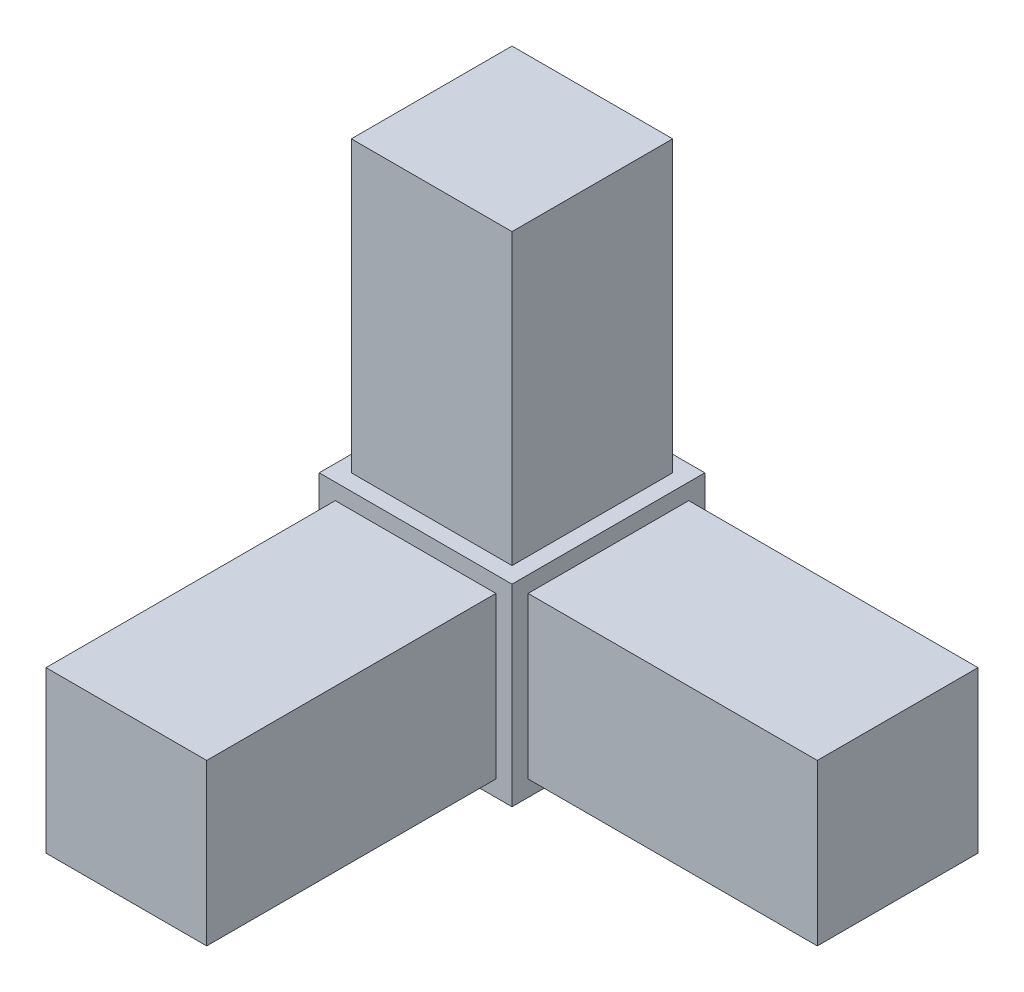
ISO-10303-21;
HEADER;
FILE_DESCRIPTION(('STEP AP214'),'2;1');
FILE_NAME('part.step','',(''),(''),'','','');
FILE_SCHEMA(('AUTOMOTIVE_DESIGN { 1 0 10303 214 1 1 1 1 }'));
ENDSEC;
DATA;
#1=APPLICATION_CONTEXT('core data for automotive mechanical design processes');
#2=APPLICATION_PROTOCOL_DEFINITION('international standard','automotive_design',2000,#1);
#3=PRODUCT_CONTEXT('',#1,'mechanical');
#4=PRODUCT('Part','Part','',(#3));
#5=PRODUCT_RELATED_PRODUCT_CATEGORY('part','',(#4));
#6=PRODUCT_DEFINITION_FORMATION('','',#4);
#7=PRODUCT_DEFINITION_CONTEXT('part definition',#1,'design');
#8=PRODUCT_DEFINITION('design','',#6,#7);
#9=PRODUCT_DEFINITION_SHAPE('','',#8);
#10=(LENGTH_UNIT() NAMED_UNIT(*) SI_UNIT(.MILLI.,.METRE.));
#11=(NAMED_UNIT(*) PLANE_ANGLE_UNIT() SI_UNIT($,.RADIAN.));
#12=(NAMED_UNIT(*) SI_UNIT($,.STERADIAN.) SOLID_ANGLE_UNIT());
#13=UNCERTAINTY_MEASURE_WITH_UNIT(LENGTH_MEASURE(1.E-05),#10,'distance_accuracy_value','');
#14=(GEOMETRIC_REPRESENTATION_CONTEXT(3) GLOBAL_UNCERTAINTY_ASSIGNED_CONTEXT((#13)) GLOBAL_UNIT_ASSIGNED_CONTEXT((#10,
#11,#12)) REPRESENTATION_CONTEXT('',''));
#15=CARTESIAN_POINT('',(0.,0.,0.));
#16=DIRECTION('',(0.,0.,1.));
#17=DIRECTION('',(1.,0.,0.));
#18=AXIS2_PLACEMENT_3D('',#15,#16,#17);
#19=CARTESIAN_POINT('',(0.,0.,19.05));
#20=DIRECTION('',(0.,0.,1.));
#21=DIRECTION('',(1.,0.,0.));
#22=AXIS2_PLACEMENT_3D('',#19,#20,#21);
#23=PLANE('',#22);
#24=DIRECTION('',(0.,-1.,0.));
#25=VECTOR('',#24,1.);
#26=CARTESIAN_POINT('',(-9.525,-9.525,19.05));
#27=LINE('',#26,#25);
#28=CARTESIAN_POINT('',(-9.525,9.525,19.05));
#29=VERTEX_POINT('',#28);
#30=CARTESIAN_POINT('',(-9.525,-9.525,19.05));
#31=VERTEX_POINT('',#30);
#32=EDGE_CURVE('E239',#29,#31,#27,.T.);
#33=ORIENTED_EDGE('',*,*,#32,.T.);
#34=DIRECTION('',(1.,0.,0.));
#35=VECTOR('',#34,1.);
#36=CARTESIAN_POINT('',(9.525,-9.525,19.05));
#37=LINE('',#36,#35);
#38=CARTESIAN_POINT('',(9.525,-9.525,19.05));
#39=VERTEX_POINT('',#38);
#40=EDGE_CURVE('E242',#31,#39,#37,.T.);
#41=ORIENTED_EDGE('',*,*,#40,.T.);
#42=DIRECTION('',(0.,1.,0.));
#43=VECTOR('',#42,1.);
#44=CARTESIAN_POINT('',(9.525,-9.525,19.05));
#45=LINE('',#44,#43);
#46=CARTESIAN_POINT('',(9.525,9.525,19.05));
#47=VERTEX_POINT('',#46);
#48=EDGE_CURVE('E245',#39,#47,#45,.T.);
#49=ORIENTED_EDGE('',*,*,#48,.T.);
#50=DIRECTION('',(-1.,0.,0.));
#51=VECTOR('',#50,1.);
#52=CARTESIAN_POINT('',(9.525,9.525,19.05));
#53=LINE('',#52,#51);
#54=EDGE_CURVE('E247',#47,#29,#53,.T.);
#55=ORIENTED_EDGE('',*,*,#54,.T.);
#56=EDGE_LOOP('',(#33,#41,#49,#55));
#57=FACE_BOUND('',#56,.T.);
#58=DIRECTION('',(1.,0.,0.));
#59=VECTOR('',#58,1.);
#60=CARTESIAN_POINT('',(7.9375,-7.9375,19.05));
#61=LINE('',#60,#59);
#62=CARTESIAN_POINT('',(-7.9375,-7.9375,19.05));
#63=VERTEX_POINT('',#62);
#64=CARTESIAN_POINT('',(7.9375,-7.9375,19.05));
#65=VERTEX_POINT('',#64);
#66=EDGE_CURVE('E479',#63,#65,#61,.T.);
#67=ORIENTED_EDGE('',*,*,#66,.F.);
#68=DIRECTION('',(0.,-1.,0.));
#69=VECTOR('',#68,1.);
#70=CARTESIAN_POINT('',(-7.9375,-7.9375,19.05));
#71=LINE('',#70,#69);
#72=CARTESIAN_POINT('',(-7.9375,7.9375,19.05));
#73=VERTEX_POINT('',#72);
#74=EDGE_CURVE('E169',#73,#63,#71,.T.);
#75=ORIENTED_EDGE('',*,*,#74,.F.);
#76=DIRECTION('',(-1.,0.,0.));
#77=VECTOR('',#76,1.);
#78=CARTESIAN_POINT('',(7.9375,7.9375,19.05));
#79=LINE('',#78,#77);
#80=CARTESIAN_POINT('',(7.9375,7.9375,19.05));
#81=VERTEX_POINT('',#80);
#82=EDGE_CURVE('E165',#81,#73,#79,.T.);
#83=ORIENTED_EDGE('',*,*,#82,.F.);
#84=DIRECTION('',(0.,1.,0.));
#85=VECTOR('',#84,1.);
#86=CARTESIAN_POINT('',(7.9375,-7.9375,19.05));
#87=LINE('',#86,#85);
#88=EDGE_CURVE('E476',#65,#81,#87,.T.);
#89=ORIENTED_EDGE('',*,*,#88,.F.);
#90=EDGE_LOOP('',(#67,#75,#83,#89));
#91=FACE_BOUND('',#90,.T.);
#92=ADVANCED_FACE('F33',(#57,#91),#23,.T.);
#93=CARTESIAN_POINT('',(9.525,-9.525,19.05));
#94=DIRECTION('',(-1.,0.,0.));
#95=DIRECTION('',(0.,0.,1.));
#96=AXIS2_PLACEMENT_3D('',#93,#94,#95);
#97=PLANE('',#96);
#98=DIRECTION('',(0.,1.,0.));
#99=VECTOR('',#98,1.);
#100=CARTESIAN_POINT('',(9.525,-9.525,0.));
#101=LINE('',#100,#99);
#102=CARTESIAN_POINT('',(9.525,-9.525,0.));
#103=VERTEX_POINT('',#102);
#104=CARTESIAN_POINT('',(9.525,9.525,0.));
#105=VERTEX_POINT('',#104);
#106=EDGE_CURVE('E254',#103,#105,#101,.T.);
#107=ORIENTED_EDGE('',*,*,#106,.T.);
#108=DIRECTION('',(0.,0.,-1.));
#109=VECTOR('',#108,1.);
#110=CARTESIAN_POINT('',(9.525,9.525,19.05));
#111=LINE('',#110,#109);
#112=EDGE_CURVE('E259',#47,#105,#111,.T.);
#113=ORIENTED_EDGE('',*,*,#112,.F.);
#114=ORIENTED_EDGE('',*,*,#48,.F.);
#115=DIRECTION('',(0.,0.,-1.));
#116=VECTOR('',#115,1.);
#117=CARTESIAN_POINT('',(9.525,-9.525,19.05));
#118=LINE('',#117,#116);
#119=EDGE_CURVE('E41',#39,#103,#118,.T.);
#120=ORIENTED_EDGE('',*,*,#119,.T.);
#121=EDGE_LOOP('',(#107,#113,#114,#120));
#122=FACE_BOUND('',#121,.T.);
#123=DIRECTION('',(0.,1.,0.));
#124=VECTOR('',#123,1.);
#125=CARTESIAN_POINT('',(9.525,-7.93749999999999,1.5875));
#126=LINE('',#125,#124);
#127=CARTESIAN_POINT('',(9.525,-7.93749999999999,1.5875));
#128=VERTEX_POINT('',#127);
#129=CARTESIAN_POINT('',(9.525,7.93750000000001,1.58750000000001));
#130=VERTEX_POINT('',#129);
#131=EDGE_CURVE('E171',#128,#130,#126,.T.);
#132=ORIENTED_EDGE('',*,*,#131,.F.);
#133=DIRECTION('',(0.,0.,-1.));
#134=VECTOR('',#133,1.);
#135=CARTESIAN_POINT('',(9.525,-7.93749999999999,17.4625));
#136=LINE('',#135,#134);
#137=CARTESIAN_POINT('',(9.525,-7.93749999999999,17.4625));
#138=VERTEX_POINT('',#137);
#139=EDGE_CURVE('E182',#138,#128,#136,.T.);
#140=ORIENTED_EDGE('',*,*,#139,.F.);
#141=DIRECTION('',(0.,-1.,0.));
#142=VECTOR('',#141,1.);
#143=CARTESIAN_POINT('',(9.525,-7.93749999999999,17.4625));
#144=LINE('',#143,#142);
#145=CARTESIAN_POINT('',(9.525,7.9375,17.4625));
#146=VERTEX_POINT('',#145);
#147=EDGE_CURVE('E190',#146,#138,#144,.T.);
#148=ORIENTED_EDGE('',*,*,#147,.F.);
#149=DIRECTION('',(0.,0.,1.));
#150=VECTOR('',#149,1.);
#151=CARTESIAN_POINT('',(9.525,7.93750000000001,17.4625));
#152=LINE('',#151,#150);
#153=EDGE_CURVE('E56',#130,#146,#152,.T.);
#154=ORIENTED_EDGE('',*,*,#153,.F.);
#155=EDGE_LOOP('',(#132,#140,#148,#154));
#156=FACE_BOUND('',#155,.T.);
#157=ADVANCED_FACE('F266',(#122,#156),#97,.F.);
#158=CARTESIAN_POINT('',(9.525,9.525,19.05));
#159=DIRECTION('',(0.,-1.,0.));
#160=DIRECTION('',(1.,0.,0.));
#161=AXIS2_PLACEMENT_3D('',#158,#159,#160);
#162=PLANE('',#161);
#163=DIRECTION('',(-1.,0.,0.));
#164=VECTOR('',#163,1.);
#165=CARTESIAN_POINT('',(9.525,9.525,0.));
#166=LINE('',#165,#164);
#167=CARTESIAN_POINT('',(-9.525,9.525,0.));
#168=VERTEX_POINT('',#167);
#169=EDGE_CURVE('E243',#105,#168,#166,.T.);
#170=ORIENTED_EDGE('',*,*,#169,.T.);
#171=DIRECTION('',(0.,0.,-1.));
#172=VECTOR('',#171,1.);
#173=CARTESIAN_POINT('',(-9.525,9.525,19.05));
#174=LINE('',#173,#172);
#175=EDGE_CURVE('E249',#29,#168,#174,.T.);
#176=ORIENTED_EDGE('',*,*,#175,.F.);
#177=ORIENTED_EDGE('',*,*,#54,.F.);
#178=ORIENTED_EDGE('',*,*,#112,.T.);
#179=EDGE_LOOP('',(#170,#176,#177,#178));
#180=FACE_BOUND('',#179,.T.);
#181=DIRECTION('',(0.,0.,-1.));
#182=VECTOR('',#181,1.);
#183=CARTESIAN_POINT('',(7.9375,9.525,1.58750000000001));
#184=LINE('',#183,#182);
#185=CARTESIAN_POINT('',(7.9375,9.525,17.4625));
#186=VERTEX_POINT('',#185);
#187=CARTESIAN_POINT('',(7.9375,9.525,1.58750000000001));
#188=VERTEX_POINT('',#187);
#189=EDGE_CURVE('E205',#186,#188,#184,.T.);
#190=ORIENTED_EDGE('',*,*,#189,.F.);
#191=DIRECTION('',(1.,0.,0.));
#192=VECTOR('',#191,1.);
#193=CARTESIAN_POINT('',(-7.9375,9.525,17.4625));
#194=LINE('',#193,#192);
#195=CARTESIAN_POINT('',(-7.9375,9.525,17.4625));
#196=VERTEX_POINT('',#195);
#197=EDGE_CURVE('E210',#196,#186,#194,.T.);
#198=ORIENTED_EDGE('',*,*,#197,.F.);
#199=DIRECTION('',(0.,0.,1.));
#200=VECTOR('',#199,1.);
#201=CARTESIAN_POINT('',(-7.9375,9.525,1.58750000000001));
#202=LINE('',#201,#200);
#203=CARTESIAN_POINT('',(-7.9375,9.525,1.58750000000001));
#204=VERTEX_POINT('',#203);
#205=EDGE_CURVE('E222',#204,#196,#202,.T.);
#206=ORIENTED_EDGE('',*,*,#205,.F.);
#207=DIRECTION('',(-1.,0.,0.));
#208=VECTOR('',#207,1.);
#209=CARTESIAN_POINT('',(-7.9375,9.525,1.58750000000001));
#210=LINE('',#209,#208);
#211=EDGE_CURVE('E219',#188,#204,#210,.T.);
#212=ORIENTED_EDGE('',*,*,#211,.F.);
#213=EDGE_LOOP('',(#190,#198,#206,#212));
#214=FACE_BOUND('',#213,.T.);
#215=ADVANCED_FACE('F275',(#180,#214),#162,.F.);
#216=CARTESIAN_POINT('',(-9.525,-9.525,19.05));
#217=DIRECTION('',(1.,0.,0.));
#218=DIRECTION('',(0.,0.,-1.));
#219=AXIS2_PLACEMENT_3D('',#216,#217,#218);
#220=PLANE('',#219);
#221=DIRECTION('',(0.,-1.,0.));
#222=VECTOR('',#221,1.);
#223=CARTESIAN_POINT('',(-9.525,-9.525,0.));
#224=LINE('',#223,#222);
#225=CARTESIAN_POINT('',(-9.525,-9.525,0.));
#226=VERTEX_POINT('',#225);
#227=EDGE_CURVE('E238',#168,#226,#224,.T.);
#228=ORIENTED_EDGE('',*,*,#227,.T.);
#229=DIRECTION('',(0.,0.,-1.));
#230=VECTOR('',#229,1.);
#231=CARTESIAN_POINT('',(-9.525,-9.525,19.05));
#232=LINE('',#231,#230);
#233=EDGE_CURVE('E11',#31,#226,#232,.T.);
#234=ORIENTED_EDGE('',*,*,#233,.F.);
#235=ORIENTED_EDGE('',*,*,#32,.F.);
#236=ORIENTED_EDGE('',*,*,#175,.T.);
#237=EDGE_LOOP('',(#228,#234,#235,#236));
#238=FACE_BOUND('',#237,.T.);
#239=ADVANCED_FACE('F35',(#238),#220,.F.);
#240=CARTESIAN_POINT('',(9.525,-9.525,19.05));
#241=DIRECTION('',(0.,1.,0.));
#242=DIRECTION('',(-1.,0.,0.));
#243=AXIS2_PLACEMENT_3D('',#240,#241,#242);
#244=PLANE('',#243);
#245=DIRECTION('',(1.,0.,0.));
#246=VECTOR('',#245,1.);
#247=CARTESIAN_POINT('',(9.525,-9.525,0.));
#248=LINE('',#247,#246);
#249=EDGE_CURVE('E252',#226,#103,#248,.T.);
#250=ORIENTED_EDGE('',*,*,#249,.T.);
#251=ORIENTED_EDGE('',*,*,#119,.F.);
#252=ORIENTED_EDGE('',*,*,#40,.F.);
#253=ORIENTED_EDGE('',*,*,#233,.T.);
#254=EDGE_LOOP('',(#250,#251,#252,#253));
#255=FACE_BOUND('',#254,.T.);
#256=ADVANCED_FACE('F283',(#255),#244,.F.);
#257=CARTESIAN_POINT('',(0.,0.,0.));
#258=DIRECTION('',(0.,0.,1.));
#259=DIRECTION('',(1.,0.,0.));
#260=AXIS2_PLACEMENT_3D('',#257,#258,#259);
#261=PLANE('',#260);
#262=ORIENTED_EDGE('',*,*,#227,.F.);
#263=ORIENTED_EDGE('',*,*,#169,.F.);
#264=ORIENTED_EDGE('',*,*,#106,.F.);
#265=ORIENTED_EDGE('',*,*,#249,.F.);
#266=EDGE_LOOP('',(#262,#263,#264,#265));
#267=FACE_BOUND('',#266,.T.);
#268=ADVANCED_FACE('F272',(#267),#261,.F.);
#269=CARTESIAN_POINT('',(7.9375,38.1,1.58750000000001));
#270=DIRECTION('',(-1.,0.,0.));
#271=DIRECTION('',(0.,0.,1.));
#272=AXIS2_PLACEMENT_3D('',#269,#270,#271);
#273=PLANE('',#272);
#274=ORIENTED_EDGE('',*,*,#189,.T.);
#275=DIRECTION('',(0.,-1.,0.));
#276=VECTOR('',#275,1.);
#277=CARTESIAN_POINT('',(7.9375,38.1,1.58750000000001));
#278=LINE('',#277,#276);
#279=CARTESIAN_POINT('',(7.9375,38.1,1.58750000000001));
#280=VERTEX_POINT('',#279);
#281=EDGE_CURVE('E235',#280,#188,#278,.T.);
#282=ORIENTED_EDGE('',*,*,#281,.F.);
#283=DIRECTION('',(0.,0.,-1.));
#284=VECTOR('',#283,1.);
#285=CARTESIAN_POINT('',(7.9375,38.1,1.58750000000001));
#286=LINE('',#285,#284);
#287=CARTESIAN_POINT('',(7.9375,38.1,17.4625));
#288=VERTEX_POINT('',#287);
#289=EDGE_CURVE('E206',#288,#280,#286,.T.);
#290=ORIENTED_EDGE('',*,*,#289,.F.);
#291=DIRECTION('',(0.,-1.,0.));
#292=VECTOR('',#291,1.);
#293=CARTESIAN_POINT('',(7.9375,38.1,17.4625));
#294=LINE('',#293,#292);
#295=EDGE_CURVE('E216',#288,#186,#294,.T.);
#296=ORIENTED_EDGE('',*,*,#295,.T.);
#297=EDGE_LOOP('',(#274,#282,#290,#296));
#298=FACE_BOUND('',#297,.T.);
#299=ADVANCED_FACE('F289',(#298),#273,.F.);
#300=CARTESIAN_POINT('',(-7.9375,38.1,1.58750000000001));
#301=DIRECTION('',(0.,0.,1.));
#302=DIRECTION('',(1.,0.,0.));
#303=AXIS2_PLACEMENT_3D('',#300,#301,#302);
#304=PLANE('',#303);
#305=ORIENTED_EDGE('',*,*,#211,.T.);
#306=DIRECTION('',(0.,-1.,0.));
#307=VECTOR('',#306,1.);
#308=CARTESIAN_POINT('',(-7.9375,38.1,1.58750000000001));
#309=LINE('',#308,#307);
#310=CARTESIAN_POINT('',(-7.9375,38.1,1.58750000000001));
#311=VERTEX_POINT('',#310);
#312=EDGE_CURVE('E232',#311,#204,#309,.T.);
#313=ORIENTED_EDGE('',*,*,#312,.F.);
#314=DIRECTION('',(-1.,0.,0.));
#315=VECTOR('',#314,1.);
#316=CARTESIAN_POINT('',(-7.9375,38.1,1.58750000000001));
#317=LINE('',#316,#315);
#318=EDGE_CURVE('E209',#280,#311,#317,.T.);
#319=ORIENTED_EDGE('',*,*,#318,.F.);
#320=ORIENTED_EDGE('',*,*,#281,.T.);
#321=EDGE_LOOP('',(#305,#313,#319,#320));
#322=FACE_BOUND('',#321,.T.);
#323=ADVANCED_FACE('F327',(#322),#304,.F.);
#324=CARTESIAN_POINT('',(-7.9375,38.1,1.58750000000001));
#325=DIRECTION('',(1.,0.,0.));
#326=DIRECTION('',(0.,0.,-1.));
#327=AXIS2_PLACEMENT_3D('',#324,#325,#326);
#328=PLANE('',#327);
#329=ORIENTED_EDGE('',*,*,#205,.T.);
#330=DIRECTION('',(0.,-1.,0.));
#331=VECTOR('',#330,1.);
#332=CARTESIAN_POINT('',(-7.9375,38.1,17.4625));
#333=LINE('',#332,#331);
#334=CARTESIAN_POINT('',(-7.9375,38.1,17.4625));
#335=VERTEX_POINT('',#334);
#336=EDGE_CURVE('E229',#335,#196,#333,.T.);
#337=ORIENTED_EDGE('',*,*,#336,.F.);
#338=DIRECTION('',(0.,0.,1.));
#339=VECTOR('',#338,1.);
#340=CARTESIAN_POINT('',(-7.9375,38.1,1.58750000000001));
#341=LINE('',#340,#339);
#342=EDGE_CURVE('E212',#311,#335,#341,.T.);
#343=ORIENTED_EDGE('',*,*,#342,.F.);
#344=ORIENTED_EDGE('',*,*,#312,.T.);
#345=EDGE_LOOP('',(#329,#337,#343,#344));
#346=FACE_BOUND('',#345,.T.);
#347=ADVANCED_FACE('F334',(#346),#328,.F.);
#348=CARTESIAN_POINT('',(-7.9375,38.1,17.4625));
#349=DIRECTION('',(0.,0.,-1.));
#350=DIRECTION('',(-1.,0.,0.));
#351=AXIS2_PLACEMENT_3D('',#348,#349,#350);
#352=PLANE('',#351);
#353=ORIENTED_EDGE('',*,*,#197,.T.);
#354=ORIENTED_EDGE('',*,*,#295,.F.);
#355=DIRECTION('',(1.,0.,0.));
#356=VECTOR('',#355,1.);
#357=CARTESIAN_POINT('',(-7.9375,38.1,17.4625));
#358=LINE('',#357,#356);
#359=EDGE_CURVE('E214',#335,#288,#358,.T.);
#360=ORIENTED_EDGE('',*,*,#359,.F.);
#361=ORIENTED_EDGE('',*,*,#336,.T.);
#362=EDGE_LOOP('',(#353,#354,#360,#361));
#363=FACE_BOUND('',#362,.T.);
#364=ADVANCED_FACE('F341',(#363),#352,.F.);
#365=CARTESIAN_POINT('',(0.,38.1,0.));
#366=DIRECTION('',(0.,1.,0.));
#367=DIRECTION('',(0.,0.,1.));
#368=AXIS2_PLACEMENT_3D('',#365,#366,#367);
#369=PLANE('',#368);
#370=ORIENTED_EDGE('',*,*,#289,.T.);
#371=ORIENTED_EDGE('',*,*,#318,.T.);
#372=ORIENTED_EDGE('',*,*,#342,.T.);
#373=ORIENTED_EDGE('',*,*,#359,.T.);
#374=EDGE_LOOP('',(#370,#371,#372,#373));
#375=FACE_BOUND('',#374,.T.);
#376=ADVANCED_FACE('F349',(#375),#369,.T.);
#377=CARTESIAN_POINT('',(38.1,-7.93749999999999,1.5875));
#378=DIRECTION('',(0.,0.,1.));
#379=DIRECTION('',(1.,0.,0.));
#380=AXIS2_PLACEMENT_3D('',#377,#378,#379);
#381=PLANE('',#380);
#382=ORIENTED_EDGE('',*,*,#131,.T.);
#383=DIRECTION('',(-1.,0.,0.));
#384=VECTOR('',#383,1.);
#385=CARTESIAN_POINT('',(38.1,7.93750000000001,1.5875));
#386=LINE('',#385,#384);
#387=CARTESIAN_POINT('',(38.1,7.93750000000001,1.5875));
#388=VERTEX_POINT('',#387);
#389=EDGE_CURVE('E203',#388,#130,#386,.T.);
#390=ORIENTED_EDGE('',*,*,#389,.F.);
#391=DIRECTION('',(0.,1.,0.));
#392=VECTOR('',#391,1.);
#393=CARTESIAN_POINT('',(38.1,-7.93749999999999,1.5875));
#394=LINE('',#393,#392);
#395=CARTESIAN_POINT('',(38.1,-7.93749999999999,1.5875));
#396=VERTEX_POINT('',#395);
#397=EDGE_CURVE('E178',#396,#388,#394,.T.);
#398=ORIENTED_EDGE('',*,*,#397,.F.);
#399=DIRECTION('',(-1.,0.,0.));
#400=VECTOR('',#399,1.);
#401=CARTESIAN_POINT('',(38.1,-7.93749999999999,1.5875));
#402=LINE('',#401,#400);
#403=EDGE_CURVE('E187',#396,#128,#402,.T.);
#404=ORIENTED_EDGE('',*,*,#403,.T.);
#405=EDGE_LOOP('',(#382,#390,#398,#404));
#406=FACE_BOUND('',#405,.T.);
#407=ADVANCED_FACE('F357',(#406),#381,.F.);
#408=CARTESIAN_POINT('',(38.1,7.93750000000001,17.4625));
#409=DIRECTION('',(0.,-1.,0.));
#410=DIRECTION('',(0.,0.,-1.));
#411=AXIS2_PLACEMENT_3D('',#408,#409,#410);
#412=PLANE('',#411);
#413=ORIENTED_EDGE('',*,*,#153,.T.);
#414=DIRECTION('',(-1.,0.,0.));
#415=VECTOR('',#414,1.);
#416=CARTESIAN_POINT('',(38.1,7.93750000000001,17.4625));
#417=LINE('',#416,#415);
#418=CARTESIAN_POINT('',(38.1,7.93750000000001,17.4625));
#419=VERTEX_POINT('',#418);
#420=EDGE_CURVE('E200',#419,#146,#417,.T.);
#421=ORIENTED_EDGE('',*,*,#420,.F.);
#422=DIRECTION('',(0.,0.,1.));
#423=VECTOR('',#422,1.);
#424=CARTESIAN_POINT('',(38.1,7.93750000000001,17.4625));
#425=LINE('',#424,#423);
#426=EDGE_CURVE('E181',#388,#419,#425,.T.);
#427=ORIENTED_EDGE('',*,*,#426,.F.);
#428=ORIENTED_EDGE('',*,*,#389,.T.);
#429=EDGE_LOOP('',(#413,#421,#427,#428));
#430=FACE_BOUND('',#429,.T.);
#431=ADVANCED_FACE('F365',(#430),#412,.F.);
#432=CARTESIAN_POINT('',(38.1,-7.93749999999999,17.4625));
#433=DIRECTION('',(0.,0.,-1.));
#434=DIRECTION('',(0.,1.,0.));
#435=AXIS2_PLACEMENT_3D('',#432,#433,#434);
#436=PLANE('',#435);
#437=ORIENTED_EDGE('',*,*,#147,.T.);
#438=DIRECTION('',(-1.,0.,0.));
#439=VECTOR('',#438,1.);
#440=CARTESIAN_POINT('',(38.1,-7.93749999999999,17.4625));
#441=LINE('',#440,#439);
#442=CARTESIAN_POINT('',(38.1,-7.93749999999999,17.4625));
#443=VERTEX_POINT('',#442);
#444=EDGE_CURVE('E197',#443,#138,#441,.T.);
#445=ORIENTED_EDGE('',*,*,#444,.F.);
#446=DIRECTION('',(0.,-1.,0.));
#447=VECTOR('',#446,1.);
#448=CARTESIAN_POINT('',(38.1,-7.93749999999999,17.4625));
#449=LINE('',#448,#447);
#450=EDGE_CURVE('E184',#419,#443,#449,.T.);
#451=ORIENTED_EDGE('',*,*,#450,.F.);
#452=ORIENTED_EDGE('',*,*,#420,.T.);
#453=EDGE_LOOP('',(#437,#445,#451,#452));
#454=FACE_BOUND('',#453,.T.);
#455=ADVANCED_FACE('F373',(#454),#436,.F.);
#456=CARTESIAN_POINT('',(38.1,-7.93749999999999,17.4625));
#457=DIRECTION('',(0.,1.,0.));
#458=DIRECTION('',(0.,0.,1.));
#459=AXIS2_PLACEMENT_3D('',#456,#457,#458);
#460=PLANE('',#459);
#461=ORIENTED_EDGE('',*,*,#139,.T.);
#462=ORIENTED_EDGE('',*,*,#403,.F.);
#463=DIRECTION('',(0.,0.,-1.));
#464=VECTOR('',#463,1.);
#465=CARTESIAN_POINT('',(38.1,-7.93749999999999,17.4625));
#466=LINE('',#465,#464);
#467=EDGE_CURVE('E186',#443,#396,#466,.T.);
#468=ORIENTED_EDGE('',*,*,#467,.F.);
#469=ORIENTED_EDGE('',*,*,#444,.T.);
#470=EDGE_LOOP('',(#461,#462,#468,#469));
#471=FACE_BOUND('',#470,.T.);
#472=ADVANCED_FACE('F381',(#471),#460,.F.);
#473=CARTESIAN_POINT('',(38.1,0.,0.));
#474=DIRECTION('',(-1.,0.,0.));
#475=DIRECTION('',(0.,0.,1.));
#476=AXIS2_PLACEMENT_3D('',#473,#474,#475);
#477=PLANE('',#476);
#478=ORIENTED_EDGE('',*,*,#397,.T.);
#479=ORIENTED_EDGE('',*,*,#426,.T.);
#480=ORIENTED_EDGE('',*,*,#450,.T.);
#481=ORIENTED_EDGE('',*,*,#467,.T.);
#482=EDGE_LOOP('',(#478,#479,#480,#481));
#483=FACE_BOUND('',#482,.T.);
#484=ADVANCED_FACE('F389',(#483),#477,.F.);
#485=CARTESIAN_POINT('',(-7.9375,-7.9375,47.625));
#486=DIRECTION('',(1.,0.,0.));
#487=DIRECTION('',(0.,0.,-1.));
#488=AXIS2_PLACEMENT_3D('',#485,#486,#487);
#489=PLANE('',#488);
#490=ORIENTED_EDGE('',*,*,#74,.T.);
#491=DIRECTION('',(0.,0.,-1.));
#492=VECTOR('',#491,1.);
#493=CARTESIAN_POINT('',(-7.9375,-7.9375,47.625));
#494=LINE('',#493,#492);
#495=CARTESIAN_POINT('',(-7.9375,-7.9375,47.625));
#496=VERTEX_POINT('',#495);
#497=EDGE_CURVE('E150',#496,#63,#494,.T.);
#498=ORIENTED_EDGE('',*,*,#497,.F.);
#499=DIRECTION('',(0.,-1.,0.));
#500=VECTOR('',#499,1.);
#501=CARTESIAN_POINT('',(-7.9375,-7.9375,47.625));
#502=LINE('',#501,#500);
#503=CARTESIAN_POINT('',(-7.9375,7.9375,47.625));
#504=VERTEX_POINT('',#503);
#505=EDGE_CURVE('E157',#504,#496,#502,.T.);
#506=ORIENTED_EDGE('',*,*,#505,.F.);
#507=DIRECTION('',(0.,0.,-1.));
#508=VECTOR('',#507,1.);
#509=CARTESIAN_POINT('',(-7.9375,7.9375,47.625));
#510=LINE('',#509,#508);
#511=EDGE_CURVE('E474',#504,#73,#510,.T.);
#512=ORIENTED_EDGE('',*,*,#511,.T.);
#513=EDGE_LOOP('',(#490,#498,#506,#512));
#514=FACE_BOUND('',#513,.T.);
#515=ADVANCED_FACE('F167',(#514),#489,.F.);
#516=CARTESIAN_POINT('',(7.9375,-7.9375,47.625));
#517=DIRECTION('',(0.,1.,0.));
#518=DIRECTION('',(-1.,0.,0.));
#519=AXIS2_PLACEMENT_3D('',#516,#517,#518);
#520=PLANE('',#519);
#521=ORIENTED_EDGE('',*,*,#66,.T.);
#522=DIRECTION('',(0.,0.,-1.));
#523=VECTOR('',#522,1.);
#524=CARTESIAN_POINT('',(7.9375,-7.9375,47.625));
#525=LINE('',#524,#523);
#526=CARTESIAN_POINT('',(7.9375,-7.9375,47.625));
#527=VERTEX_POINT('',#526);
#528=EDGE_CURVE('E153',#527,#65,#525,.T.);
#529=ORIENTED_EDGE('',*,*,#528,.F.);
#530=DIRECTION('',(1.,0.,0.));
#531=VECTOR('',#530,1.);
#532=CARTESIAN_POINT('',(7.9375,-7.9375,47.625));
#533=LINE('',#532,#531);
#534=EDGE_CURVE('E146',#496,#527,#533,.T.);
#535=ORIENTED_EDGE('',*,*,#534,.F.);
#536=ORIENTED_EDGE('',*,*,#497,.T.);
#537=EDGE_LOOP('',(#521,#529,#535,#536));
#538=FACE_BOUND('',#537,.T.);
#539=ADVANCED_FACE('F148',(#538),#520,.F.);
#540=CARTESIAN_POINT('',(7.9375,-7.9375,47.625));
#541=DIRECTION('',(-1.,0.,0.));
#542=DIRECTION('',(0.,0.,1.));
#543=AXIS2_PLACEMENT_3D('',#540,#541,#542);
#544=PLANE('',#543);
#545=ORIENTED_EDGE('',*,*,#88,.T.);
#546=DIRECTION('',(0.,0.,-1.));
#547=VECTOR('',#546,1.);
#548=CARTESIAN_POINT('',(7.9375,7.9375,47.625));
#549=LINE('',#548,#547);
#550=CARTESIAN_POINT('',(7.9375,7.9375,47.625));
#551=VERTEX_POINT('',#550);
#552=EDGE_CURVE('E48',#551,#81,#549,.T.);
#553=ORIENTED_EDGE('',*,*,#552,.F.);
#554=DIRECTION('',(0.,1.,0.));
#555=VECTOR('',#554,1.);
#556=CARTESIAN_POINT('',(7.9375,-7.9375,47.625));
#557=LINE('',#556,#555);
#558=EDGE_CURVE('E156',#527,#551,#557,.T.);
#559=ORIENTED_EDGE('',*,*,#558,.F.);
#560=ORIENTED_EDGE('',*,*,#528,.T.);
#561=EDGE_LOOP('',(#545,#553,#559,#560));
#562=FACE_BOUND('',#561,.T.);
#563=ADVANCED_FACE('F410',(#562),#544,.F.);
#564=CARTESIAN_POINT('',(7.9375,7.9375,47.625));
#565=DIRECTION('',(0.,-1.,0.));
#566=DIRECTION('',(0.,0.,-1.));
#567=AXIS2_PLACEMENT_3D('',#564,#565,#566);
#568=PLANE('',#567);
#569=ORIENTED_EDGE('',*,*,#82,.T.);
#570=ORIENTED_EDGE('',*,*,#511,.F.);
#571=DIRECTION('',(-1.,0.,0.));
#572=VECTOR('',#571,1.);
#573=CARTESIAN_POINT('',(7.9375,7.9375,47.625));
#574=LINE('',#573,#572);
#575=EDGE_CURVE('E161',#551,#504,#574,.T.);
#576=ORIENTED_EDGE('',*,*,#575,.F.);
#577=ORIENTED_EDGE('',*,*,#552,.T.);
#578=EDGE_LOOP('',(#569,#570,#576,#577));
#579=FACE_BOUND('',#578,.T.);
#580=ADVANCED_FACE('F417',(#579),#568,.F.);
#581=CARTESIAN_POINT('',(0.,0.,47.625));
#582=DIRECTION('',(0.,0.,1.));
#583=DIRECTION('',(1.,0.,0.));
#584=AXIS2_PLACEMENT_3D('',#581,#582,#583);
#585=PLANE('',#584);
#586=ORIENTED_EDGE('',*,*,#505,.T.);
#587=ORIENTED_EDGE('',*,*,#534,.T.);
#588=ORIENTED_EDGE('',*,*,#558,.T.);
#589=ORIENTED_EDGE('',*,*,#575,.T.);
#590=EDGE_LOOP('',(#586,#587,#588,#589));
#591=FACE_BOUND('',#590,.T.);
#592=ADVANCED_FACE('F160',(#591),#585,.T.);
#593=CLOSED_SHELL('',(#92,#157,#215,#239,#256,#268,#299,#323,#347,#364,#376,#407,#431,#455,#472,
#484,#515,#539,#563,#580,#592));
#594=MANIFOLD_SOLID_BREP('B2',#593);
#595=ADVANCED_BREP_SHAPE_REPRESENTATION('',(#18,#594),#14);
#596=SHAPE_DEFINITION_REPRESENTATION(#9,#595);
ENDSEC;
END-ISO-10303-21;
